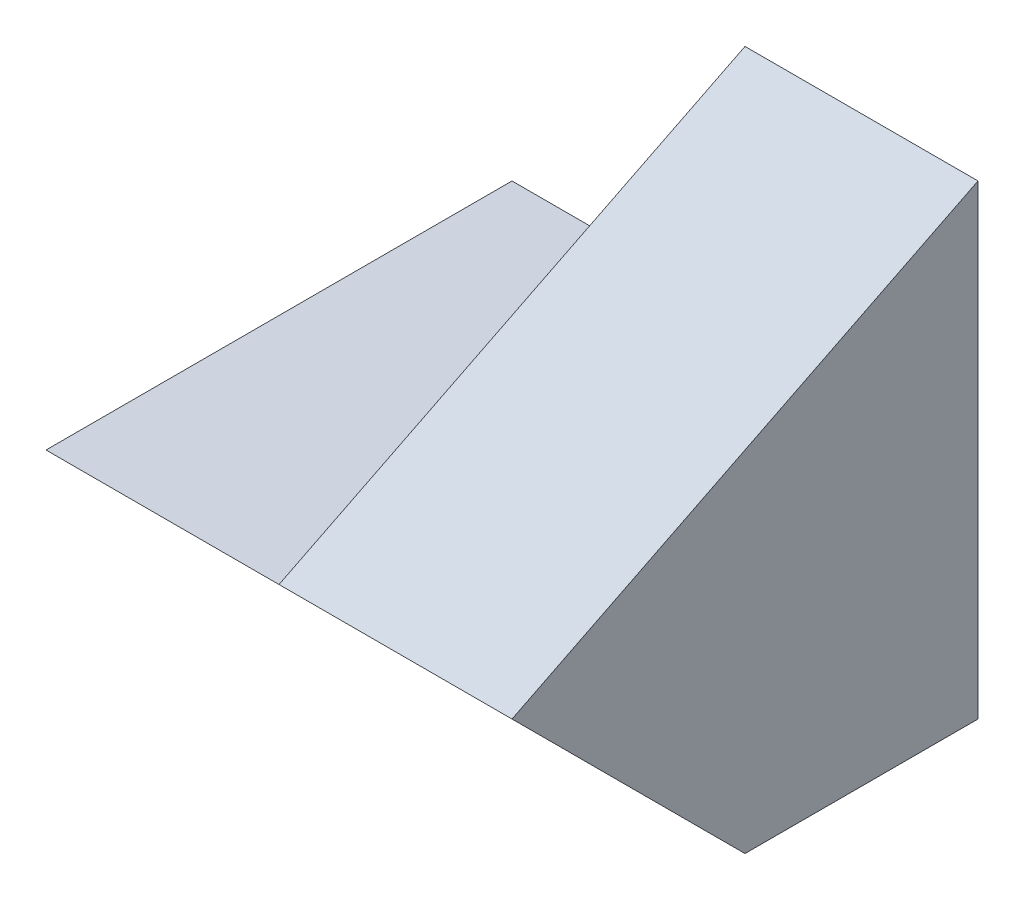
ISO-10303-21;
HEADER;
FILE_DESCRIPTION(('STEP AP214'),'2;1');
FILE_NAME('part.step','',(''),(''),'','','');
FILE_SCHEMA(('AUTOMOTIVE_DESIGN { 1 0 10303 214 1 1 1 1 }'));
ENDSEC;
DATA;
#1=APPLICATION_CONTEXT('core data for automotive mechanical design processes');
#2=APPLICATION_PROTOCOL_DEFINITION('international standard','automotive_design',2000,#1);
#3=PRODUCT_CONTEXT('',#1,'mechanical');
#4=PRODUCT('Part','Part','',(#3));
#5=PRODUCT_RELATED_PRODUCT_CATEGORY('part','',(#4));
#6=PRODUCT_DEFINITION_FORMATION('','',#4);
#7=PRODUCT_DEFINITION_CONTEXT('part definition',#1,'design');
#8=PRODUCT_DEFINITION('design','',#6,#7);
#9=PRODUCT_DEFINITION_SHAPE('','',#8);
#10=(LENGTH_UNIT() NAMED_UNIT(*) SI_UNIT(.MILLI.,.METRE.));
#11=(NAMED_UNIT(*) PLANE_ANGLE_UNIT() SI_UNIT($,.RADIAN.));
#12=(NAMED_UNIT(*) SI_UNIT($,.STERADIAN.) SOLID_ANGLE_UNIT());
#13=UNCERTAINTY_MEASURE_WITH_UNIT(LENGTH_MEASURE(1.E-05),#10,'distance_accuracy_value','');
#14=(GEOMETRIC_REPRESENTATION_CONTEXT(3) GLOBAL_UNCERTAINTY_ASSIGNED_CONTEXT((#13)) GLOBAL_UNIT_ASSIGNED_CONTEXT((#10,
#11,#12)) REPRESENTATION_CONTEXT('',''));
#15=CARTESIAN_POINT('',(0.,0.,0.));
#16=DIRECTION('',(0.,0.,1.));
#17=DIRECTION('',(1.,0.,0.));
#18=AXIS2_PLACEMENT_3D('',#15,#16,#17);
#19=CARTESIAN_POINT('',(0.,0.,40.));
#20=DIRECTION('',(1.,0.,0.));
#21=DIRECTION('',(0.,0.,-1.));
#22=AXIS2_PLACEMENT_3D('',#19,#20,#21);
#23=PLANE('',#22);
#24=DIRECTION('',(0.,0.,-1.));
#25=VECTOR('',#24,1.);
#26=CARTESIAN_POINT('',(0.,0.,40.));
#27=LINE('',#26,#25);
#28=CARTESIAN_POINT('',(0.,0.,20.));
#29=VERTEX_POINT('',#28);
#30=CARTESIAN_POINT('',(0.,0.,0.));
#31=VERTEX_POINT('',#30);
#32=EDGE_CURVE('E11',#29,#31,#27,.T.);
#33=ORIENTED_EDGE('',*,*,#32,.F.);
#34=DIRECTION('',(0.,-0.707106781186548,-0.707106781186548));
#35=VECTOR('',#34,1.);
#36=CARTESIAN_POINT('',(0.,20.,40.));
#37=LINE('',#36,#35);
#38=CARTESIAN_POINT('',(0.,20.,40.));
#39=VERTEX_POINT('',#38);
#40=EDGE_CURVE('E88',#39,#29,#37,.T.);
#41=ORIENTED_EDGE('',*,*,#40,.F.);
#42=DIRECTION('',(0.,0.,1.));
#43=VECTOR('',#42,1.);
#44=CARTESIAN_POINT('',(0.,20.,0.));
#45=LINE('',#44,#43);
#46=CARTESIAN_POINT('',(0.,20.,0.));
#47=VERTEX_POINT('',#46);
#48=EDGE_CURVE('E111',#47,#39,#45,.T.);
#49=ORIENTED_EDGE('',*,*,#48,.F.);
#50=DIRECTION('',(0.,-1.,0.));
#51=VECTOR('',#50,1.);
#52=CARTESIAN_POINT('',(0.,0.,0.));
#53=LINE('',#52,#51);
#54=EDGE_CURVE('E107',#47,#31,#53,.T.);
#55=ORIENTED_EDGE('',*,*,#54,.T.);
#56=EDGE_LOOP('',(#33,#41,#49,#55));
#57=FACE_BOUND('',#56,.T.);
#58=ADVANCED_FACE('F33',(#57),#23,.F.);
#59=CARTESIAN_POINT('',(0.,0.,40.));
#60=DIRECTION('',(0.,1.,0.));
#61=DIRECTION('',(0.,0.,1.));
#62=AXIS2_PLACEMENT_3D('',#59,#60,#61);
#63=PLANE('',#62);
#64=DIRECTION('',(0.,0.,-1.));
#65=VECTOR('',#64,1.);
#66=CARTESIAN_POINT('',(40.,0.,40.));
#67=LINE('',#66,#65);
#68=CARTESIAN_POINT('',(40.,0.,20.));
#69=VERTEX_POINT('',#68);
#70=CARTESIAN_POINT('',(40.,0.,0.));
#71=VERTEX_POINT('',#70);
#72=EDGE_CURVE('E40',#69,#71,#67,.T.);
#73=ORIENTED_EDGE('',*,*,#72,.F.);
#74=DIRECTION('',(-1.,0.,0.));
#75=VECTOR('',#74,1.);
#76=CARTESIAN_POINT('',(40.,0.,20.));
#77=LINE('',#76,#75);
#78=EDGE_CURVE('E83',#69,#29,#77,.T.);
#79=ORIENTED_EDGE('',*,*,#78,.T.);
#80=ORIENTED_EDGE('',*,*,#32,.T.);
#81=DIRECTION('',(1.,0.,0.));
#82=VECTOR('',#81,1.);
#83=CARTESIAN_POINT('',(0.,0.,0.));
#84=LINE('',#83,#82);
#85=EDGE_CURVE('E99',#31,#71,#84,.T.);
#86=ORIENTED_EDGE('',*,*,#85,.T.);
#87=EDGE_LOOP('',(#73,#79,#80,#86));
#88=FACE_BOUND('',#87,.T.);
#89=ADVANCED_FACE('F97',(#88),#63,.F.);
#90=CARTESIAN_POINT('',(40.,0.,40.));
#91=DIRECTION('',(-1.,0.,0.));
#92=DIRECTION('',(0.,0.,1.));
#93=AXIS2_PLACEMENT_3D('',#90,#91,#92);
#94=PLANE('',#93);
#95=DIRECTION('',(0.,-0.447213595499958,0.894427190999916));
#96=VECTOR('',#95,1.);
#97=CARTESIAN_POINT('',(40.,16.,48.));
#98=LINE('',#97,#96);
#99=CARTESIAN_POINT('',(40.,40.,0.));
#100=VERTEX_POINT('',#99);
#101=CARTESIAN_POINT('',(40.,20.,40.));
#102=VERTEX_POINT('',#101);
#103=EDGE_CURVE('E95',#100,#102,#98,.T.);
#104=ORIENTED_EDGE('',*,*,#103,.T.);
#105=DIRECTION('',(0.,-0.707106781186548,-0.707106781186548));
#106=VECTOR('',#105,1.);
#107=CARTESIAN_POINT('',(40.,20.,40.));
#108=LINE('',#107,#106);
#109=EDGE_CURVE('E85',#102,#69,#108,.T.);
#110=ORIENTED_EDGE('',*,*,#109,.T.);
#111=ORIENTED_EDGE('',*,*,#72,.T.);
#112=DIRECTION('',(0.,1.,0.));
#113=VECTOR('',#112,1.);
#114=CARTESIAN_POINT('',(40.,0.,0.));
#115=LINE('',#114,#113);
#116=EDGE_CURVE('E102',#71,#100,#115,.T.);
#117=ORIENTED_EDGE('',*,*,#116,.T.);
#118=EDGE_LOOP('',(#104,#110,#111,#117));
#119=FACE_BOUND('',#118,.T.);
#120=ADVANCED_FACE('F94',(#119),#94,.F.);
#121=CARTESIAN_POINT('',(0.,0.,0.));
#122=DIRECTION('',(0.,0.,-1.));
#123=DIRECTION('',(-1.,0.,0.));
#124=AXIS2_PLACEMENT_3D('',#121,#122,#123);
#125=PLANE('',#124);
#126=DIRECTION('',(0.,1.,0.));
#127=VECTOR('',#126,1.);
#128=CARTESIAN_POINT('',(20.,40.,0.));
#129=LINE('',#128,#127);
#130=CARTESIAN_POINT('',(20.,20.,0.));
#131=VERTEX_POINT('',#130);
#132=CARTESIAN_POINT('',(20.,40.,0.));
#133=VERTEX_POINT('',#132);
#134=EDGE_CURVE('E47',#131,#133,#129,.T.);
#135=ORIENTED_EDGE('',*,*,#134,.T.);
#136=DIRECTION('',(-1.,0.,0.));
#137=VECTOR('',#136,1.);
#138=CARTESIAN_POINT('',(0.,40.,0.));
#139=LINE('',#138,#137);
#140=EDGE_CURVE('E101',#100,#133,#139,.T.);
#141=ORIENTED_EDGE('',*,*,#140,.F.);
#142=ORIENTED_EDGE('',*,*,#116,.F.);
#143=ORIENTED_EDGE('',*,*,#85,.F.);
#144=ORIENTED_EDGE('',*,*,#54,.F.);
#145=DIRECTION('',(1.,0.,0.));
#146=VECTOR('',#145,1.);
#147=CARTESIAN_POINT('',(0.,20.,0.));
#148=LINE('',#147,#146);
#149=EDGE_CURVE('E118',#47,#131,#148,.T.);
#150=ORIENTED_EDGE('',*,*,#149,.T.);
#151=EDGE_LOOP('',(#135,#141,#142,#143,#144,#150));
#152=FACE_BOUND('',#151,.T.);
#153=ADVANCED_FACE('F137',(#152),#125,.T.);
#154=CARTESIAN_POINT('',(20.,40.,0.));
#155=DIRECTION('',(1.,0.,0.));
#156=DIRECTION('',(0.,1.,0.));
#157=AXIS2_PLACEMENT_3D('',#154,#155,#156);
#158=PLANE('',#157);
#159=DIRECTION('',(0.,0.,1.));
#160=VECTOR('',#159,1.);
#161=CARTESIAN_POINT('',(20.,20.,0.));
#162=LINE('',#161,#160);
#163=CARTESIAN_POINT('',(20.,20.,40.));
#164=VERTEX_POINT('',#163);
#165=EDGE_CURVE('E110',#131,#164,#162,.T.);
#166=ORIENTED_EDGE('',*,*,#165,.T.);
#167=DIRECTION('',(0.,-0.447213595499958,0.894427190999916));
#168=VECTOR('',#167,1.);
#169=CARTESIAN_POINT('',(20.,40.,0.));
#170=LINE('',#169,#168);
#171=EDGE_CURVE('E91',#133,#164,#170,.T.);
#172=ORIENTED_EDGE('',*,*,#171,.F.);
#173=ORIENTED_EDGE('',*,*,#134,.F.);
#174=EDGE_LOOP('',(#166,#172,#173));
#175=FACE_BOUND('',#174,.T.);
#176=ADVANCED_FACE('F130',(#175),#158,.F.);
#177=CARTESIAN_POINT('',(0.,20.,0.));
#178=DIRECTION('',(0.,-1.,0.));
#179=DIRECTION('',(0.,0.,-1.));
#180=AXIS2_PLACEMENT_3D('',#177,#178,#179);
#181=PLANE('',#180);
#182=DIRECTION('',(1.,0.,0.));
#183=VECTOR('',#182,1.);
#184=CARTESIAN_POINT('',(0.,20.,40.));
#185=LINE('',#184,#183);
#186=EDGE_CURVE('E115',#39,#164,#185,.T.);
#187=ORIENTED_EDGE('',*,*,#186,.T.);
#188=ORIENTED_EDGE('',*,*,#165,.F.);
#189=ORIENTED_EDGE('',*,*,#149,.F.);
#190=ORIENTED_EDGE('',*,*,#48,.T.);
#191=EDGE_LOOP('',(#187,#188,#189,#190));
#192=FACE_BOUND('',#191,.T.);
#193=ADVANCED_FACE('F132',(#192),#181,.F.);
#194=CARTESIAN_POINT('',(60.,40.,0.));
#195=DIRECTION('',(0.,-0.894427190999916,-0.447213595499958));
#196=DIRECTION('',(0.,0.447213595499958,-0.894427190999916));
#197=AXIS2_PLACEMENT_3D('',#194,#195,#196);
#198=PLANE('',#197);
#199=ORIENTED_EDGE('',*,*,#140,.T.);
#200=ORIENTED_EDGE('',*,*,#171,.T.);
#201=DIRECTION('',(-1.,0.,0.));
#202=VECTOR('',#201,1.);
#203=CARTESIAN_POINT('',(60.,20.,40.));
#204=LINE('',#203,#202);
#205=EDGE_CURVE('E123',#102,#164,#204,.T.);
#206=ORIENTED_EDGE('',*,*,#205,.F.);
#207=ORIENTED_EDGE('',*,*,#103,.F.);
#208=EDGE_LOOP('',(#199,#200,#206,#207));
#209=FACE_BOUND('',#208,.T.);
#210=ADVANCED_FACE('F128',(#209),#198,.F.);
#211=CARTESIAN_POINT('',(40.,20.,40.));
#212=DIRECTION('',(0.,0.707106781186548,-0.707106781186548));
#213=DIRECTION('',(0.,0.707106781186548,0.707106781186548));
#214=AXIS2_PLACEMENT_3D('',#211,#212,#213);
#215=PLANE('',#214);
#216=ORIENTED_EDGE('',*,*,#40,.T.);
#217=ORIENTED_EDGE('',*,*,#78,.F.);
#218=ORIENTED_EDGE('',*,*,#109,.F.);
#219=ORIENTED_EDGE('',*,*,#205,.T.);
#220=ORIENTED_EDGE('',*,*,#186,.F.);
#221=EDGE_LOOP('',(#216,#217,#218,#219,#220));
#222=FACE_BOUND('',#221,.T.);
#223=ADVANCED_FACE('F84',(#222),#215,.F.);
#224=CLOSED_SHELL('',(#58,#89,#120,#153,#176,#193,#210,#223));
#225=MANIFOLD_SOLID_BREP('B2',#224);
#226=ADVANCED_BREP_SHAPE_REPRESENTATION('',(#18,#225),#14);
#227=SHAPE_DEFINITION_REPRESENTATION(#9,#226);
ENDSEC;
END-ISO-10303-21;
